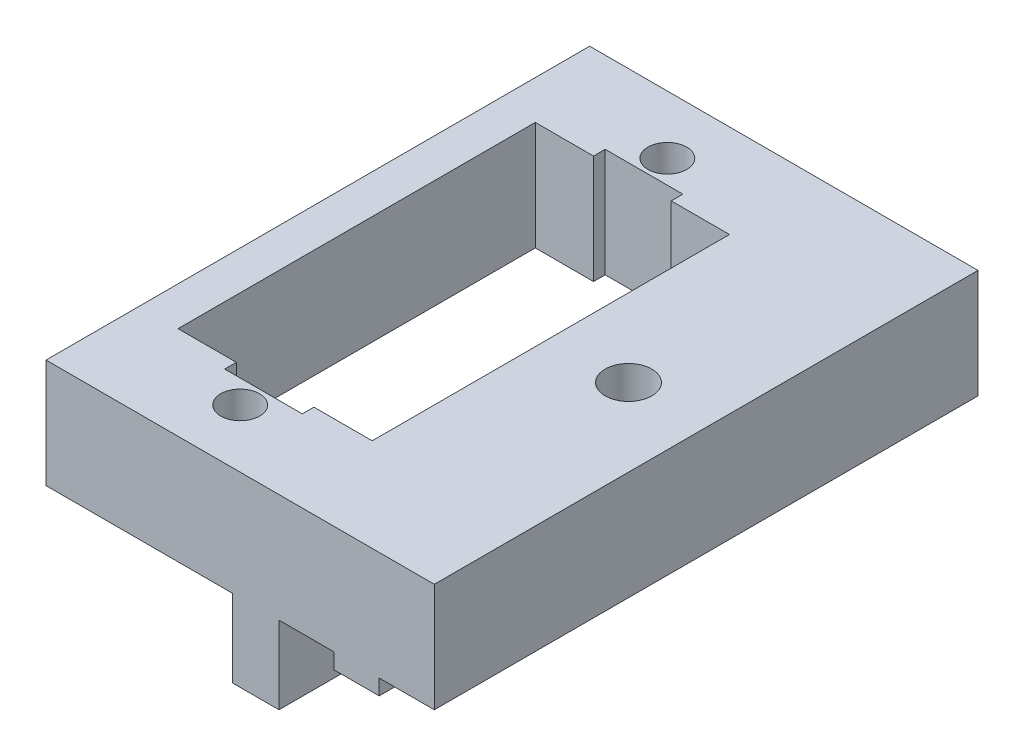
ISO-10303-21;
HEADER;
FILE_DESCRIPTION(('STEP AP214'),'2;1');
FILE_NAME('part.step','',(''),(''),'','','');
FILE_SCHEMA(('AUTOMOTIVE_DESIGN { 1 0 10303 214 1 1 1 1 }'));
ENDSEC;
DATA;
#1=APPLICATION_CONTEXT('core data for automotive mechanical design processes');
#2=APPLICATION_PROTOCOL_DEFINITION('international standard','automotive_design',2000,#1);
#3=PRODUCT_CONTEXT('',#1,'mechanical');
#4=PRODUCT('Part','Part','',(#3));
#5=PRODUCT_RELATED_PRODUCT_CATEGORY('part','',(#4));
#6=PRODUCT_DEFINITION_FORMATION('','',#4);
#7=PRODUCT_DEFINITION_CONTEXT('part definition',#1,'design');
#8=PRODUCT_DEFINITION('design','',#6,#7);
#9=PRODUCT_DEFINITION_SHAPE('','',#8);
#10=(LENGTH_UNIT() NAMED_UNIT(*) SI_UNIT(.MILLI.,.METRE.));
#11=(NAMED_UNIT(*) PLANE_ANGLE_UNIT() SI_UNIT($,.RADIAN.));
#12=(NAMED_UNIT(*) SI_UNIT($,.STERADIAN.) SOLID_ANGLE_UNIT());
#13=UNCERTAINTY_MEASURE_WITH_UNIT(LENGTH_MEASURE(1.E-05),#10,'distance_accuracy_value','');
#14=(GEOMETRIC_REPRESENTATION_CONTEXT(3) GLOBAL_UNCERTAINTY_ASSIGNED_CONTEXT((#13)) GLOBAL_UNIT_ASSIGNED_CONTEXT((#10,
#11,#12)) REPRESENTATION_CONTEXT('',''));
#15=CARTESIAN_POINT('',(0.,0.,0.));
#16=DIRECTION('',(0.,0.,1.));
#17=DIRECTION('',(1.,0.,0.));
#18=AXIS2_PLACEMENT_3D('',#15,#16,#17);
#19=CARTESIAN_POINT('',(-12.5,-5.00000000000001,-11.5));
#20=DIRECTION('',(0.,0.,-1.));
#21=DIRECTION('',(-1.,0.,0.));
#22=AXIS2_PLACEMENT_3D('',#19,#20,#21);
#23=PLANE('',#22);
#24=DIRECTION('',(-1.,0.,0.));
#25=VECTOR('',#24,1.);
#26=CARTESIAN_POINT('',(-12.5,7.,-11.5));
#27=LINE('',#26,#25);
#28=CARTESIAN_POINT('',(0.,7.,-11.5));
#29=VERTEX_POINT('',#28);
#30=CARTESIAN_POINT('',(-3.75,7.,-11.5));
#31=VERTEX_POINT('',#30);
#32=EDGE_CURVE('E288',#29,#31,#27,.T.);
#33=ORIENTED_EDGE('',*,*,#32,.T.);
#34=DIRECTION('',(0.,-1.,0.));
#35=VECTOR('',#34,1.);
#36=CARTESIAN_POINT('',(-3.75,-5.,-11.5));
#37=LINE('',#36,#35);
#38=CARTESIAN_POINT('',(-3.75,0.,-11.5));
#39=VERTEX_POINT('',#38);
#40=EDGE_CURVE('E253',#31,#39,#37,.T.);
#41=ORIENTED_EDGE('',*,*,#40,.T.);
#42=DIRECTION('',(-1.,0.,0.));
#43=VECTOR('',#42,1.);
#44=CARTESIAN_POINT('',(-15.,0.,-11.5));
#45=LINE('',#44,#43);
#46=CARTESIAN_POINT('',(-3.,0.,-11.5));
#47=VERTEX_POINT('',#46);
#48=EDGE_CURVE('E326',#47,#39,#45,.T.);
#49=ORIENTED_EDGE('',*,*,#48,.F.);
#50=DIRECTION('',(0.,1.,0.));
#51=VECTOR('',#50,1.);
#52=CARTESIAN_POINT('',(-3.,0.,-11.5));
#53=LINE('',#52,#51);
#54=CARTESIAN_POINT('',(-3.,-5.,-11.5));
#55=VERTEX_POINT('',#54);
#56=EDGE_CURVE('E322',#55,#47,#53,.T.);
#57=ORIENTED_EDGE('',*,*,#56,.F.);
#58=DIRECTION('',(-1.,0.,0.));
#59=VECTOR('',#58,1.);
#60=CARTESIAN_POINT('',(-12.5,-5.00000000000001,-11.5));
#61=LINE('',#60,#59);
#62=CARTESIAN_POINT('',(0.,-5.,-11.5));
#63=VERTEX_POINT('',#62);
#64=EDGE_CURVE('E287',#63,#55,#61,.T.);
#65=ORIENTED_EDGE('',*,*,#64,.F.);
#66=DIRECTION('',(0.,1.,0.));
#67=VECTOR('',#66,1.);
#68=CARTESIAN_POINT('',(0.,-5.,-11.5));
#69=LINE('',#68,#67);
#70=CARTESIAN_POINT('',(0.,0.,-11.5));
#71=VERTEX_POINT('',#70);
#72=EDGE_CURVE('E307',#63,#71,#69,.T.);
#73=ORIENTED_EDGE('',*,*,#72,.T.);
#74=EDGE_CURVE('E309',#71,#29,#69,.T.);
#75=ORIENTED_EDGE('',*,*,#74,.T.);
#76=EDGE_LOOP('',(#33,#41,#49,#57,#65,#73,#75));
#77=FACE_BOUND('',#76,.T.);
#78=ADVANCED_FACE('F33',(#77),#23,.F.);
#79=CARTESIAN_POINT('',(-12.5,-5.00000000000001,11.5));
#80=DIRECTION('',(0.,0.,1.));
#81=DIRECTION('',(1.,0.,0.));
#82=AXIS2_PLACEMENT_3D('',#79,#80,#81);
#83=PLANE('',#82);
#84=DIRECTION('',(1.,0.,0.));
#85=VECTOR('',#84,1.);
#86=CARTESIAN_POINT('',(-15.,0.,11.5));
#87=LINE('',#86,#85);
#88=CARTESIAN_POINT('',(-3.75,0.,11.5));
#89=VERTEX_POINT('',#88);
#90=CARTESIAN_POINT('',(-3.,0.,11.5));
#91=VERTEX_POINT('',#90);
#92=EDGE_CURVE('E318',#89,#91,#87,.T.);
#93=ORIENTED_EDGE('',*,*,#92,.F.);
#94=DIRECTION('',(0.,1.,0.));
#95=VECTOR('',#94,1.);
#96=CARTESIAN_POINT('',(-3.75,-5.,11.5));
#97=LINE('',#96,#95);
#98=CARTESIAN_POINT('',(-3.75,7.,11.5));
#99=VERTEX_POINT('',#98);
#100=EDGE_CURVE('E474',#89,#99,#97,.T.);
#101=ORIENTED_EDGE('',*,*,#100,.T.);
#102=DIRECTION('',(1.,0.,0.));
#103=VECTOR('',#102,1.);
#104=CARTESIAN_POINT('',(-12.5,7.,11.5));
#105=LINE('',#104,#103);
#106=CARTESIAN_POINT('',(0.,7.,11.5));
#107=VERTEX_POINT('',#106);
#108=EDGE_CURVE('E294',#99,#107,#105,.T.);
#109=ORIENTED_EDGE('',*,*,#108,.T.);
#110=DIRECTION('',(0.,1.,0.));
#111=VECTOR('',#110,1.);
#112=CARTESIAN_POINT('',(0.,-5.,11.5));
#113=LINE('',#112,#111);
#114=CARTESIAN_POINT('',(0.,0.,11.5));
#115=VERTEX_POINT('',#114);
#116=EDGE_CURVE('E313',#115,#107,#113,.T.);
#117=ORIENTED_EDGE('',*,*,#116,.F.);
#118=CARTESIAN_POINT('',(0.,-5.,11.5));
#119=VERTEX_POINT('',#118);
#120=EDGE_CURVE('E310',#119,#115,#113,.T.);
#121=ORIENTED_EDGE('',*,*,#120,.F.);
#122=DIRECTION('',(1.,0.,0.));
#123=VECTOR('',#122,1.);
#124=CARTESIAN_POINT('',(-12.5,-5.00000000000001,11.5));
#125=LINE('',#124,#123);
#126=CARTESIAN_POINT('',(-3.,-5.,11.5));
#127=VERTEX_POINT('',#126);
#128=EDGE_CURVE('E284',#127,#119,#125,.T.);
#129=ORIENTED_EDGE('',*,*,#128,.F.);
#130=DIRECTION('',(0.,-1.,0.));
#131=VECTOR('',#130,1.);
#132=CARTESIAN_POINT('',(-3.,0.,11.5));
#133=LINE('',#132,#131);
#134=EDGE_CURVE('E306',#91,#127,#133,.T.);
#135=ORIENTED_EDGE('',*,*,#134,.F.);
#136=EDGE_LOOP('',(#93,#101,#109,#117,#121,#129,#135));
#137=FACE_BOUND('',#136,.T.);
#138=ADVANCED_FACE('F494',(#137),#83,.F.);
#139=CARTESIAN_POINT('',(-3.,0.,17.5));
#140=DIRECTION('',(1.,0.,0.));
#141=DIRECTION('',(0.,1.,0.));
#142=AXIS2_PLACEMENT_3D('',#139,#140,#141);
#143=PLANE('',#142);
#144=DIRECTION('',(0.,0.,-1.));
#145=VECTOR('',#144,1.);
#146=CARTESIAN_POINT('',(-3.,-5.,17.5));
#147=LINE('',#146,#145);
#148=CARTESIAN_POINT('',(-3.,-5.,-17.5));
#149=VERTEX_POINT('',#148);
#150=EDGE_CURVE('E439',#55,#149,#147,.T.);
#151=ORIENTED_EDGE('',*,*,#150,.F.);
#152=ORIENTED_EDGE('',*,*,#56,.T.);
#153=DIRECTION('',(0.,0.,-1.));
#154=VECTOR('',#153,1.);
#155=CARTESIAN_POINT('',(-3.,0.,17.5));
#156=LINE('',#155,#154);
#157=CARTESIAN_POINT('',(-3.,0.,-17.5));
#158=VERTEX_POINT('',#157);
#159=EDGE_CURVE('E443',#47,#158,#156,.T.);
#160=ORIENTED_EDGE('',*,*,#159,.T.);
#161=DIRECTION('',(0.,-1.,0.));
#162=VECTOR('',#161,1.);
#163=CARTESIAN_POINT('',(-3.,0.,-17.5));
#164=LINE('',#163,#162);
#165=EDGE_CURVE('E395',#158,#149,#164,.T.);
#166=ORIENTED_EDGE('',*,*,#165,.T.);
#167=EDGE_LOOP('',(#151,#152,#160,#166));
#168=FACE_BOUND('',#167,.T.);
#169=ADVANCED_FACE('F554',(#168),#143,.F.);
#170=CARTESIAN_POINT('',(-3.,-5.,17.5));
#171=DIRECTION('',(0.,1.,0.));
#172=DIRECTION('',(-1.,0.,0.));
#173=AXIS2_PLACEMENT_3D('',#170,#171,#172);
#174=PLANE('',#173);
#175=DIRECTION('',(0.,0.,-1.));
#176=VECTOR('',#175,1.);
#177=CARTESIAN_POINT('',(0.,-5.,17.5));
#178=LINE('',#177,#176);
#179=CARTESIAN_POINT('',(0.,-5.,-17.5));
#180=VERTEX_POINT('',#179);
#181=EDGE_CURVE('E434',#63,#180,#178,.T.);
#182=ORIENTED_EDGE('',*,*,#181,.F.);
#183=ORIENTED_EDGE('',*,*,#64,.T.);
#184=ORIENTED_EDGE('',*,*,#150,.T.);
#185=DIRECTION('',(1.,0.,0.));
#186=VECTOR('',#185,1.);
#187=CARTESIAN_POINT('',(-3.,-5.,-17.5));
#188=LINE('',#187,#186);
#189=EDGE_CURVE('E398',#149,#180,#188,.T.);
#190=ORIENTED_EDGE('',*,*,#189,.T.);
#191=EDGE_LOOP('',(#182,#183,#184,#190));
#192=FACE_BOUND('',#191,.T.);
#193=ADVANCED_FACE('F607',(#192),#174,.F.);
#194=CARTESIAN_POINT('',(0.,-5.,17.5));
#195=DIRECTION('',(-1.,0.,0.));
#196=DIRECTION('',(0.,-1.,0.));
#197=AXIS2_PLACEMENT_3D('',#194,#195,#196);
#198=PLANE('',#197);
#199=DIRECTION('',(0.,0.,-1.));
#200=VECTOR('',#199,1.);
#201=CARTESIAN_POINT('',(0.,0.,17.5));
#202=LINE('',#201,#200);
#203=CARTESIAN_POINT('',(0.,0.,-17.5));
#204=VERTEX_POINT('',#203);
#205=EDGE_CURVE('E430',#71,#204,#202,.T.);
#206=ORIENTED_EDGE('',*,*,#205,.F.);
#207=ORIENTED_EDGE('',*,*,#72,.F.);
#208=ORIENTED_EDGE('',*,*,#181,.T.);
#209=DIRECTION('',(0.,1.,0.));
#210=VECTOR('',#209,1.);
#211=CARTESIAN_POINT('',(0.,-5.,-17.5));
#212=LINE('',#211,#210);
#213=EDGE_CURVE('E401',#180,#204,#212,.T.);
#214=ORIENTED_EDGE('',*,*,#213,.T.);
#215=EDGE_LOOP('',(#206,#207,#208,#214));
#216=FACE_BOUND('',#215,.T.);
#217=ADVANCED_FACE('F604',(#216),#198,.F.);
#218=CARTESIAN_POINT('',(3.55,0.,17.5));
#219=DIRECTION('',(1.,0.,0.));
#220=DIRECTION('',(0.,1.,0.));
#221=AXIS2_PLACEMENT_3D('',#218,#219,#220);
#222=PLANE('',#221);
#223=DIRECTION('',(0.,0.,-1.));
#224=VECTOR('',#223,1.);
#225=CARTESIAN_POINT('',(3.55,-1.,17.5));
#226=LINE('',#225,#224);
#227=CARTESIAN_POINT('',(3.55,-1.,-0.384057287393424));
#228=VERTEX_POINT('',#227);
#229=CARTESIAN_POINT('',(3.55,-1.,-17.5));
#230=VERTEX_POINT('',#229);
#231=EDGE_CURVE('E422',#228,#230,#226,.T.);
#232=ORIENTED_EDGE('',*,*,#231,.F.);
#233=DIRECTION('',(0.,1.,0.));
#234=VECTOR('',#233,1.);
#235=CARTESIAN_POINT('',(3.55,-5.,-0.384057287393427));
#236=LINE('',#235,#234);
#237=CARTESIAN_POINT('',(3.55,0.,-0.384057287393427));
#238=VERTEX_POINT('',#237);
#239=EDGE_CURVE('E343',#228,#238,#236,.T.);
#240=ORIENTED_EDGE('',*,*,#239,.T.);
#241=DIRECTION('',(0.,0.,-1.));
#242=VECTOR('',#241,1.);
#243=CARTESIAN_POINT('',(3.55,0.,17.5));
#244=LINE('',#243,#242);
#245=CARTESIAN_POINT('',(3.55,0.,-17.5));
#246=VERTEX_POINT('',#245);
#247=EDGE_CURVE('E426',#238,#246,#244,.T.);
#248=ORIENTED_EDGE('',*,*,#247,.T.);
#249=DIRECTION('',(0.,-1.,0.));
#250=VECTOR('',#249,1.);
#251=CARTESIAN_POINT('',(3.55,0.,-17.5));
#252=LINE('',#251,#250);
#253=EDGE_CURVE('E407',#246,#230,#252,.T.);
#254=ORIENTED_EDGE('',*,*,#253,.T.);
#255=EDGE_LOOP('',(#232,#240,#248,#254));
#256=FACE_BOUND('',#255,.T.);
#257=ADVANCED_FACE('F599',(#256),#222,.F.);
#258=CARTESIAN_POINT('',(3.55,-1.,17.5));
#259=DIRECTION('',(0.,1.,0.));
#260=DIRECTION('',(-1.,0.,0.));
#261=AXIS2_PLACEMENT_3D('',#258,#259,#260);
#262=PLANE('',#261);
#263=CARTESIAN_POINT('',(3.55,-1.,17.5));
#264=VERTEX_POINT('',#263);
#265=CARTESIAN_POINT('',(3.55,-1.,0.384057287393424));
#266=VERTEX_POINT('',#265);
#267=EDGE_CURVE('E423',#264,#266,#226,.T.);
#268=ORIENTED_EDGE('',*,*,#267,.T.);
#269=CARTESIAN_POINT('',(5.,-1.,0.));
#270=DIRECTION('',(0.,1.,0.));
#271=DIRECTION('',(-1.,0.,0.));
#272=AXIS2_PLACEMENT_3D('',#269,#270,#271);
#273=CIRCLE('',#272,1.5);
#274=CARTESIAN_POINT('',(6.45,-1.,0.384057287393439));
#275=VERTEX_POINT('',#274);
#276=EDGE_CURVE('E344',#266,#275,#273,.T.);
#277=ORIENTED_EDGE('',*,*,#276,.T.);
#278=DIRECTION('',(0.,0.,-1.));
#279=VECTOR('',#278,1.);
#280=CARTESIAN_POINT('',(6.45,-1.,17.5));
#281=LINE('',#280,#279);
#282=CARTESIAN_POINT('',(6.45,-1.,17.5));
#283=VERTEX_POINT('',#282);
#284=EDGE_CURVE('E419',#283,#275,#281,.T.);
#285=ORIENTED_EDGE('',*,*,#284,.F.);
#286=DIRECTION('',(1.,0.,0.));
#287=VECTOR('',#286,1.);
#288=CARTESIAN_POINT('',(3.55,-1.,17.5));
#289=LINE('',#288,#287);
#290=EDGE_CURVE('E379',#264,#283,#289,.T.);
#291=ORIENTED_EDGE('',*,*,#290,.F.);
#292=EDGE_LOOP('',(#268,#277,#285,#291));
#293=FACE_BOUND('',#292,.T.);
#294=ADVANCED_FACE('F595',(#293),#262,.F.);
#295=CARTESIAN_POINT('',(6.45,-1.,17.5));
#296=DIRECTION('',(-1.,0.,0.));
#297=DIRECTION('',(0.,0.,1.));
#298=AXIS2_PLACEMENT_3D('',#295,#296,#297);
#299=PLANE('',#298);
#300=ORIENTED_EDGE('',*,*,#284,.T.);
#301=DIRECTION('',(0.,1.,0.));
#302=VECTOR('',#301,1.);
#303=CARTESIAN_POINT('',(6.45,-5.,0.384057287393439));
#304=LINE('',#303,#302);
#305=CARTESIAN_POINT('',(6.45,0.,0.384057287393436));
#306=VERTEX_POINT('',#305);
#307=EDGE_CURVE('E462',#275,#306,#304,.T.);
#308=ORIENTED_EDGE('',*,*,#307,.T.);
#309=DIRECTION('',(0.,0.,-1.));
#310=VECTOR('',#309,1.);
#311=CARTESIAN_POINT('',(6.45,0.,17.5));
#312=LINE('',#311,#310);
#313=CARTESIAN_POINT('',(6.45,0.,17.5));
#314=VERTEX_POINT('',#313);
#315=EDGE_CURVE('E415',#314,#306,#312,.T.);
#316=ORIENTED_EDGE('',*,*,#315,.F.);
#317=DIRECTION('',(0.,1.,0.));
#318=VECTOR('',#317,1.);
#319=CARTESIAN_POINT('',(6.45,-1.,17.5));
#320=LINE('',#319,#318);
#321=EDGE_CURVE('E381',#283,#314,#320,.T.);
#322=ORIENTED_EDGE('',*,*,#321,.F.);
#323=EDGE_LOOP('',(#300,#308,#316,#322));
#324=FACE_BOUND('',#323,.T.);
#325=ADVANCED_FACE('F590',(#324),#299,.F.);
#326=CARTESIAN_POINT('',(6.45,0.,17.5));
#327=DIRECTION('',(0.,1.,0.));
#328=DIRECTION('',(0.,0.,1.));
#329=AXIS2_PLACEMENT_3D('',#326,#327,#328);
#330=PLANE('',#329);
#331=ORIENTED_EDGE('',*,*,#315,.T.);
#332=CARTESIAN_POINT('',(5.,0.,0.));
#333=DIRECTION('',(0.,1.,0.));
#334=DIRECTION('',(0.,0.,1.));
#335=AXIS2_PLACEMENT_3D('',#332,#333,#334);
#336=CIRCLE('',#335,1.5);
#337=CARTESIAN_POINT('',(6.45,0.,-0.384057287393439));
#338=VERTEX_POINT('',#337);
#339=EDGE_CURVE('E350',#306,#338,#336,.T.);
#340=ORIENTED_EDGE('',*,*,#339,.T.);
#341=CARTESIAN_POINT('',(6.45,0.,-17.5));
#342=VERTEX_POINT('',#341);
#343=EDGE_CURVE('E383',#338,#342,#312,.T.);
#344=ORIENTED_EDGE('',*,*,#343,.T.);
#345=DIRECTION('',(1.,0.,0.));
#346=VECTOR('',#345,1.);
#347=CARTESIAN_POINT('',(6.45,0.,-17.5));
#348=LINE('',#347,#346);
#349=CARTESIAN_POINT('',(10.,0.,-17.5));
#350=VERTEX_POINT('',#349);
#351=EDGE_CURVE('E356',#342,#350,#348,.T.);
#352=ORIENTED_EDGE('',*,*,#351,.T.);
#353=DIRECTION('',(0.,0.,-1.));
#354=VECTOR('',#353,1.);
#355=CARTESIAN_POINT('',(10.,0.,17.5));
#356=LINE('',#355,#354);
#357=CARTESIAN_POINT('',(10.,0.,17.5));
#358=VERTEX_POINT('',#357);
#359=EDGE_CURVE('E456',#358,#350,#356,.T.);
#360=ORIENTED_EDGE('',*,*,#359,.F.);
#361=DIRECTION('',(1.,0.,0.));
#362=VECTOR('',#361,1.);
#363=CARTESIAN_POINT('',(6.45,0.,17.5));
#364=LINE('',#363,#362);
#365=EDGE_CURVE('E357',#314,#358,#364,.T.);
#366=ORIENTED_EDGE('',*,*,#365,.F.);
#367=EDGE_LOOP('',(#331,#340,#344,#352,#360,#366));
#368=FACE_BOUND('',#367,.T.);
#369=ADVANCED_FACE('F35',(#368),#330,.F.);
#370=CARTESIAN_POINT('',(10.,0.,17.5));
#371=DIRECTION('',(-1.,0.,0.));
#372=DIRECTION('',(0.,0.,1.));
#373=AXIS2_PLACEMENT_3D('',#370,#371,#372);
#374=PLANE('',#373);
#375=DIRECTION('',(0.,1.,0.));
#376=VECTOR('',#375,1.);
#377=CARTESIAN_POINT('',(10.,0.,-17.5));
#378=LINE('',#377,#376);
#379=CARTESIAN_POINT('',(10.,7.,-17.5));
#380=VERTEX_POINT('',#379);
#381=EDGE_CURVE('E386',#350,#380,#378,.T.);
#382=ORIENTED_EDGE('',*,*,#381,.T.);
#383=DIRECTION('',(0.,0.,-1.));
#384=VECTOR('',#383,1.);
#385=CARTESIAN_POINT('',(10.,7.,17.5));
#386=LINE('',#385,#384);
#387=CARTESIAN_POINT('',(10.,7.,17.5));
#388=VERTEX_POINT('',#387);
#389=EDGE_CURVE('E453',#388,#380,#386,.T.);
#390=ORIENTED_EDGE('',*,*,#389,.F.);
#391=DIRECTION('',(0.,1.,0.));
#392=VECTOR('',#391,1.);
#393=CARTESIAN_POINT('',(10.,0.,17.5));
#394=LINE('',#393,#392);
#395=EDGE_CURVE('E360',#358,#388,#394,.T.);
#396=ORIENTED_EDGE('',*,*,#395,.F.);
#397=ORIENTED_EDGE('',*,*,#359,.T.);
#398=EDGE_LOOP('',(#382,#390,#396,#397));
#399=FACE_BOUND('',#398,.T.);
#400=ADVANCED_FACE('F616',(#399),#374,.F.);
#401=CARTESIAN_POINT('',(10.,7.,17.5));
#402=DIRECTION('',(0.,-1.,0.));
#403=DIRECTION('',(1.,0.,0.));
#404=AXIS2_PLACEMENT_3D('',#401,#402,#403);
#405=PLANE('',#404);
#406=ORIENTED_EDGE('',*,*,#108,.F.);
#407=DIRECTION('',(0.,0.,-1.));
#408=VECTOR('',#407,1.);
#409=CARTESIAN_POINT('',(-3.75,7.,12.25));
#410=LINE('',#409,#408);
#411=CARTESIAN_POINT('',(-3.75,7.,12.25));
#412=VERTEX_POINT('',#411);
#413=EDGE_CURVE('E257',#412,#99,#410,.T.);
#414=ORIENTED_EDGE('',*,*,#413,.F.);
#415=DIRECTION('',(1.,0.,0.));
#416=VECTOR('',#415,1.);
#417=CARTESIAN_POINT('',(-3.75,7.,12.25));
#418=LINE('',#417,#416);
#419=CARTESIAN_POINT('',(-8.75,7.,12.25));
#420=VERTEX_POINT('',#419);
#421=EDGE_CURVE('E247',#420,#412,#418,.T.);
#422=ORIENTED_EDGE('',*,*,#421,.F.);
#423=DIRECTION('',(0.,0.,1.));
#424=VECTOR('',#423,1.);
#425=CARTESIAN_POINT('',(-8.75,7.,12.25));
#426=LINE('',#425,#424);
#427=CARTESIAN_POINT('',(-8.75,7.,11.5));
#428=VERTEX_POINT('',#427);
#429=EDGE_CURVE('E263',#428,#420,#426,.T.);
#430=ORIENTED_EDGE('',*,*,#429,.F.);
#431=CARTESIAN_POINT('',(-12.5,7.,11.5));
#432=VERTEX_POINT('',#431);
#433=EDGE_CURVE('E295',#432,#428,#105,.T.);
#434=ORIENTED_EDGE('',*,*,#433,.F.);
#435=DIRECTION('',(0.,0.,1.));
#436=VECTOR('',#435,1.);
#437=CARTESIAN_POINT('',(-12.5,7.,-11.5));
#438=LINE('',#437,#436);
#439=CARTESIAN_POINT('',(-12.5,7.,-11.5));
#440=VERTEX_POINT('',#439);
#441=EDGE_CURVE('E292',#440,#432,#438,.T.);
#442=ORIENTED_EDGE('',*,*,#441,.F.);
#443=CARTESIAN_POINT('',(-8.75,7.,-11.5));
#444=VERTEX_POINT('',#443);
#445=EDGE_CURVE('E301',#444,#440,#27,.T.);
#446=ORIENTED_EDGE('',*,*,#445,.F.);
#447=CARTESIAN_POINT('',(-8.75,7.,-12.25));
#448=VERTEX_POINT('',#447);
#449=EDGE_CURVE('E48',#448,#444,#426,.T.);
#450=ORIENTED_EDGE('',*,*,#449,.F.);
#451=DIRECTION('',(-1.,0.,0.));
#452=VECTOR('',#451,1.);
#453=CARTESIAN_POINT('',(-3.75,7.,-12.25));
#454=LINE('',#453,#452);
#455=CARTESIAN_POINT('',(-3.75,7.,-12.25));
#456=VERTEX_POINT('',#455);
#457=EDGE_CURVE('E242',#456,#448,#454,.T.);
#458=ORIENTED_EDGE('',*,*,#457,.F.);
#459=EDGE_CURVE('E250',#31,#456,#410,.T.);
#460=ORIENTED_EDGE('',*,*,#459,.F.);
#461=ORIENTED_EDGE('',*,*,#32,.F.);
#462=DIRECTION('',(0.,0.,-1.));
#463=VECTOR('',#462,1.);
#464=CARTESIAN_POINT('',(0.,7.,-11.5));
#465=LINE('',#464,#463);
#466=EDGE_CURVE('E298',#107,#29,#465,.T.);
#467=ORIENTED_EDGE('',*,*,#466,.F.);
#468=EDGE_LOOP('',(#406,#414,#422,#430,#434,#442,#446,#450,#458,#460,#461,#467));
#469=FACE_BOUND('',#468,.T.);
#470=CARTESIAN_POINT('',(-6.25,7.,-13.75));
#471=DIRECTION('',(0.,1.,0.));
#472=DIRECTION('',(-1.,0.,0.));
#473=AXIS2_PLACEMENT_3D('',#470,#471,#472);
#474=CIRCLE('',#473,1.25);
#475=CARTESIAN_POINT('',(-7.5,7.,-13.75));
#476=VERTEX_POINT('',#475);
#477=EDGE_CURVE('E330',#476,#476,#474,.T.);
#478=ORIENTED_EDGE('',*,*,#477,.F.);
#479=EDGE_LOOP('',(#478));
#480=FACE_BOUND('',#479,.T.);
#481=CARTESIAN_POINT('',(-6.25,7.,13.75));
#482=DIRECTION('',(0.,1.,0.));
#483=DIRECTION('',(-1.,0.,0.));
#484=AXIS2_PLACEMENT_3D('',#481,#482,#483);
#485=CIRCLE('',#484,1.25);
#486=CARTESIAN_POINT('',(-7.5,7.,13.75));
#487=VERTEX_POINT('',#486);
#488=EDGE_CURVE('E329',#487,#487,#485,.T.);
#489=ORIENTED_EDGE('',*,*,#488,.F.);
#490=EDGE_LOOP('',(#489));
#491=FACE_BOUND('',#490,.T.);
#492=CARTESIAN_POINT('',(5.,7.,0.));
#493=DIRECTION('',(0.,1.,0.));
#494=DIRECTION('',(-1.,0.,0.));
#495=AXIS2_PLACEMENT_3D('',#492,#493,#494);
#496=CIRCLE('',#495,1.5);
#497=CARTESIAN_POINT('',(3.5,7.,0.));
#498=VERTEX_POINT('',#497);
#499=EDGE_CURVE('E336',#498,#498,#496,.T.);
#500=ORIENTED_EDGE('',*,*,#499,.F.);
#501=EDGE_LOOP('',(#500));
#502=FACE_BOUND('',#501,.T.);
#503=DIRECTION('',(-1.,0.,0.));
#504=VECTOR('',#503,1.);
#505=CARTESIAN_POINT('',(10.,7.,-17.5));
#506=LINE('',#505,#504);
#507=CARTESIAN_POINT('',(-15.,7.,-17.5));
#508=VERTEX_POINT('',#507);
#509=EDGE_CURVE('E388',#380,#508,#506,.T.);
#510=ORIENTED_EDGE('',*,*,#509,.T.);
#511=DIRECTION('',(0.,0.,-1.));
#512=VECTOR('',#511,1.);
#513=CARTESIAN_POINT('',(-15.,7.,17.5));
#514=LINE('',#513,#512);
#515=CARTESIAN_POINT('',(-15.,7.,17.5));
#516=VERTEX_POINT('',#515);
#517=EDGE_CURVE('E450',#516,#508,#514,.T.);
#518=ORIENTED_EDGE('',*,*,#517,.F.);
#519=DIRECTION('',(-1.,0.,0.));
#520=VECTOR('',#519,1.);
#521=CARTESIAN_POINT('',(10.,7.,17.5));
#522=LINE('',#521,#520);
#523=EDGE_CURVE('E363',#388,#516,#522,.T.);
#524=ORIENTED_EDGE('',*,*,#523,.F.);
#525=ORIENTED_EDGE('',*,*,#389,.T.);
#526=EDGE_LOOP('',(#510,#518,#524,#525));
#527=FACE_BOUND('',#526,.T.);
#528=ADVANCED_FACE('F260',(#469,#480,#491,#502,#527),#405,.F.);
#529=CARTESIAN_POINT('',(-15.,7.,17.5));
#530=DIRECTION('',(1.,0.,0.));
#531=DIRECTION('',(0.,1.,0.));
#532=AXIS2_PLACEMENT_3D('',#529,#530,#531);
#533=PLANE('',#532);
#534=DIRECTION('',(0.,-1.,0.));
#535=VECTOR('',#534,1.);
#536=CARTESIAN_POINT('',(-15.,7.,-17.5));
#537=LINE('',#536,#535);
#538=CARTESIAN_POINT('',(-15.,0.,-17.5));
#539=VERTEX_POINT('',#538);
#540=EDGE_CURVE('E390',#508,#539,#537,.T.);
#541=ORIENTED_EDGE('',*,*,#540,.T.);
#542=DIRECTION('',(0.,0.,-1.));
#543=VECTOR('',#542,1.);
#544=CARTESIAN_POINT('',(-15.,0.,17.5));
#545=LINE('',#544,#543);
#546=CARTESIAN_POINT('',(-15.,0.,17.5));
#547=VERTEX_POINT('',#546);
#548=EDGE_CURVE('E447',#547,#539,#545,.T.);
#549=ORIENTED_EDGE('',*,*,#548,.F.);
#550=DIRECTION('',(0.,-1.,0.));
#551=VECTOR('',#550,1.);
#552=CARTESIAN_POINT('',(-15.,7.,17.5));
#553=LINE('',#552,#551);
#554=EDGE_CURVE('E365',#516,#547,#553,.T.);
#555=ORIENTED_EDGE('',*,*,#554,.F.);
#556=ORIENTED_EDGE('',*,*,#517,.T.);
#557=EDGE_LOOP('',(#541,#549,#555,#556));
#558=FACE_BOUND('',#557,.T.);
#559=ADVANCED_FACE('F611',(#558),#533,.F.);
#560=CARTESIAN_POINT('',(-15.,0.,17.5));
#561=DIRECTION('',(0.,1.,0.));
#562=DIRECTION('',(-1.,0.,0.));
#563=AXIS2_PLACEMENT_3D('',#560,#561,#562);
#564=PLANE('',#563);
#565=DIRECTION('',(1.,0.,0.));
#566=VECTOR('',#565,1.);
#567=CARTESIAN_POINT('',(-15.,0.,12.25));
#568=LINE('',#567,#566);
#569=CARTESIAN_POINT('',(-8.75,0.,12.25));
#570=VERTEX_POINT('',#569);
#571=CARTESIAN_POINT('',(-3.75,0.,12.25));
#572=VERTEX_POINT('',#571);
#573=EDGE_CURVE('E11',#570,#572,#568,.T.);
#574=ORIENTED_EDGE('',*,*,#573,.T.);
#575=DIRECTION('',(0.,0.,-1.));
#576=VECTOR('',#575,1.);
#577=CARTESIAN_POINT('',(-3.75,0.,17.5));
#578=LINE('',#577,#576);
#579=EDGE_CURVE('E279',#572,#89,#578,.T.);
#580=ORIENTED_EDGE('',*,*,#579,.T.);
#581=ORIENTED_EDGE('',*,*,#92,.T.);
#582=CARTESIAN_POINT('',(-3.,0.,17.5));
#583=VERTEX_POINT('',#582);
#584=EDGE_CURVE('E444',#583,#91,#156,.T.);
#585=ORIENTED_EDGE('',*,*,#584,.F.);
#586=DIRECTION('',(1.,0.,0.));
#587=VECTOR('',#586,1.);
#588=CARTESIAN_POINT('',(-15.,0.,17.5));
#589=LINE('',#588,#587);
#590=EDGE_CURVE('E367',#547,#583,#589,.T.);
#591=ORIENTED_EDGE('',*,*,#590,.F.);
#592=ORIENTED_EDGE('',*,*,#548,.T.);
#593=DIRECTION('',(1.,0.,0.));
#594=VECTOR('',#593,1.);
#595=CARTESIAN_POINT('',(-15.,0.,-17.5));
#596=LINE('',#595,#594);
#597=EDGE_CURVE('E392',#539,#158,#596,.T.);
#598=ORIENTED_EDGE('',*,*,#597,.T.);
#599=ORIENTED_EDGE('',*,*,#159,.F.);
#600=ORIENTED_EDGE('',*,*,#48,.T.);
#601=CARTESIAN_POINT('',(-3.75,0.,-12.25));
#602=VERTEX_POINT('',#601);
#603=EDGE_CURVE('E282',#39,#602,#578,.T.);
#604=ORIENTED_EDGE('',*,*,#603,.T.);
#605=DIRECTION('',(-1.,0.,0.));
#606=VECTOR('',#605,1.);
#607=CARTESIAN_POINT('',(-15.,0.,-12.25));
#608=LINE('',#607,#606);
#609=CARTESIAN_POINT('',(-8.75,0.,-12.25));
#610=VERTEX_POINT('',#609);
#611=EDGE_CURVE('E41',#602,#610,#608,.T.);
#612=ORIENTED_EDGE('',*,*,#611,.T.);
#613=DIRECTION('',(0.,0.,1.));
#614=VECTOR('',#613,1.);
#615=CARTESIAN_POINT('',(-8.75,0.,17.5));
#616=LINE('',#615,#614);
#617=CARTESIAN_POINT('',(-8.75,0.,-11.5));
#618=VERTEX_POINT('',#617);
#619=EDGE_CURVE('E277',#610,#618,#616,.T.);
#620=ORIENTED_EDGE('',*,*,#619,.T.);
#621=CARTESIAN_POINT('',(-12.5,0.,-11.5));
#622=VERTEX_POINT('',#621);
#623=EDGE_CURVE('E325',#618,#622,#45,.T.);
#624=ORIENTED_EDGE('',*,*,#623,.T.);
#625=DIRECTION('',(0.,0.,1.));
#626=VECTOR('',#625,1.);
#627=CARTESIAN_POINT('',(-12.5,0.,17.5));
#628=LINE('',#627,#626);
#629=CARTESIAN_POINT('',(-12.5,0.,11.5));
#630=VERTEX_POINT('',#629);
#631=EDGE_CURVE('E465',#622,#630,#628,.T.);
#632=ORIENTED_EDGE('',*,*,#631,.T.);
#633=CARTESIAN_POINT('',(-8.75,0.,11.5));
#634=VERTEX_POINT('',#633);
#635=EDGE_CURVE('E319',#630,#634,#87,.T.);
#636=ORIENTED_EDGE('',*,*,#635,.T.);
#637=EDGE_CURVE('E56',#634,#570,#616,.T.);
#638=ORIENTED_EDGE('',*,*,#637,.T.);
#639=EDGE_LOOP('',(#574,#580,#581,#585,#591,#592,#598,#599,#600,#604,#612,#620,#624,#632,#636,#638));
#640=FACE_BOUND('',#639,.T.);
#641=CARTESIAN_POINT('',(-6.25,0.,-13.75));
#642=DIRECTION('',(0.,1.,0.));
#643=DIRECTION('',(-1.,0.,0.));
#644=AXIS2_PLACEMENT_3D('',#641,#642,#643);
#645=CIRCLE('',#644,1.25);
#646=CARTESIAN_POINT('',(-7.5,0.,-13.75));
#647=VERTEX_POINT('',#646);
#648=EDGE_CURVE('E340',#647,#647,#645,.T.);
#649=ORIENTED_EDGE('',*,*,#648,.T.);
#650=EDGE_LOOP('',(#649));
#651=FACE_BOUND('',#650,.T.);
#652=CARTESIAN_POINT('',(-6.25,0.,13.75));
#653=DIRECTION('',(0.,1.,0.));
#654=DIRECTION('',(-1.,0.,0.));
#655=AXIS2_PLACEMENT_3D('',#652,#653,#654);
#656=CIRCLE('',#655,1.25);
#657=CARTESIAN_POINT('',(-7.5,0.,13.75));
#658=VERTEX_POINT('',#657);
#659=EDGE_CURVE('E333',#658,#658,#656,.T.);
#660=ORIENTED_EDGE('',*,*,#659,.T.);
#661=EDGE_LOOP('',(#660));
#662=FACE_BOUND('',#661,.T.);
#663=ADVANCED_FACE('F478',(#640,#651,#662),#564,.F.);
#664=ORIENTED_EDGE('',*,*,#584,.T.);
#665=ORIENTED_EDGE('',*,*,#134,.T.);
#666=CARTESIAN_POINT('',(-3.,-5.,17.5));
#667=VERTEX_POINT('',#666);
#668=EDGE_CURVE('E440',#667,#127,#147,.T.);
#669=ORIENTED_EDGE('',*,*,#668,.F.);
#670=DIRECTION('',(0.,-1.,0.));
#671=VECTOR('',#670,1.);
#672=CARTESIAN_POINT('',(-3.,0.,17.5));
#673=LINE('',#672,#671);
#674=EDGE_CURVE('E369',#583,#667,#673,.T.);
#675=ORIENTED_EDGE('',*,*,#674,.F.);
#676=EDGE_LOOP('',(#664,#665,#669,#675));
#677=FACE_BOUND('',#676,.T.);
#678=ADVANCED_FACE('F516',(#677),#143,.F.);
#679=ORIENTED_EDGE('',*,*,#668,.T.);
#680=ORIENTED_EDGE('',*,*,#128,.T.);
#681=CARTESIAN_POINT('',(0.,-5.,17.5));
#682=VERTEX_POINT('',#681);
#683=EDGE_CURVE('E436',#682,#119,#178,.T.);
#684=ORIENTED_EDGE('',*,*,#683,.F.);
#685=DIRECTION('',(1.,0.,0.));
#686=VECTOR('',#685,1.);
#687=CARTESIAN_POINT('',(-3.,-5.,17.5));
#688=LINE('',#687,#686);
#689=EDGE_CURVE('E371',#667,#682,#688,.T.);
#690=ORIENTED_EDGE('',*,*,#689,.F.);
#691=EDGE_LOOP('',(#679,#680,#684,#690));
#692=FACE_BOUND('',#691,.T.);
#693=ADVANCED_FACE('F513',(#692),#174,.F.);
#694=ORIENTED_EDGE('',*,*,#683,.T.);
#695=ORIENTED_EDGE('',*,*,#120,.T.);
#696=CARTESIAN_POINT('',(0.,0.,17.5));
#697=VERTEX_POINT('',#696);
#698=EDGE_CURVE('E431',#697,#115,#202,.T.);
#699=ORIENTED_EDGE('',*,*,#698,.F.);
#700=DIRECTION('',(0.,1.,0.));
#701=VECTOR('',#700,1.);
#702=CARTESIAN_POINT('',(0.,-5.,17.5));
#703=LINE('',#702,#701);
#704=EDGE_CURVE('E373',#682,#697,#703,.T.);
#705=ORIENTED_EDGE('',*,*,#704,.F.);
#706=EDGE_LOOP('',(#694,#695,#699,#705));
#707=FACE_BOUND('',#706,.T.);
#708=ADVANCED_FACE('F497',(#707),#198,.F.);
#709=CARTESIAN_POINT('',(0.,0.,17.5));
#710=DIRECTION('',(0.,1.,0.));
#711=DIRECTION('',(-1.,0.,0.));
#712=AXIS2_PLACEMENT_3D('',#709,#710,#711);
#713=PLANE('',#712);
#714=ORIENTED_EDGE('',*,*,#247,.F.);
#715=CARTESIAN_POINT('',(5.,0.,0.));
#716=DIRECTION('',(0.,1.,0.));
#717=DIRECTION('',(-1.,0.,0.));
#718=AXIS2_PLACEMENT_3D('',#715,#716,#717);
#719=CIRCLE('',#718,1.5);
#720=CARTESIAN_POINT('',(3.55,0.,0.384057287393423));
#721=VERTEX_POINT('',#720);
#722=EDGE_CURVE('E347',#238,#721,#719,.T.);
#723=ORIENTED_EDGE('',*,*,#722,.T.);
#724=CARTESIAN_POINT('',(3.55,0.,17.5));
#725=VERTEX_POINT('',#724);
#726=EDGE_CURVE('E427',#725,#721,#244,.T.);
#727=ORIENTED_EDGE('',*,*,#726,.F.);
#728=DIRECTION('',(1.,0.,0.));
#729=VECTOR('',#728,1.);
#730=CARTESIAN_POINT('',(0.,0.,17.5));
#731=LINE('',#730,#729);
#732=EDGE_CURVE('E375',#697,#725,#731,.T.);
#733=ORIENTED_EDGE('',*,*,#732,.F.);
#734=ORIENTED_EDGE('',*,*,#698,.T.);
#735=EDGE_CURVE('E435',#115,#71,#202,.T.);
#736=ORIENTED_EDGE('',*,*,#735,.T.);
#737=ORIENTED_EDGE('',*,*,#205,.T.);
#738=DIRECTION('',(1.,0.,0.));
#739=VECTOR('',#738,1.);
#740=CARTESIAN_POINT('',(0.,0.,-17.5));
#741=LINE('',#740,#739);
#742=EDGE_CURVE('E404',#204,#246,#741,.T.);
#743=ORIENTED_EDGE('',*,*,#742,.T.);
#744=EDGE_LOOP('',(#714,#723,#727,#733,#734,#736,#737,#743));
#745=FACE_BOUND('',#744,.T.);
#746=ADVANCED_FACE('F503',(#745),#713,.F.);
#747=ORIENTED_EDGE('',*,*,#726,.T.);
#748=DIRECTION('',(0.,1.,0.));
#749=VECTOR('',#748,1.);
#750=CARTESIAN_POINT('',(3.55,-5.,0.384057287393427));
#751=LINE('',#750,#749);
#752=EDGE_CURVE('E353',#721,#266,#751,.F.);
#753=ORIENTED_EDGE('',*,*,#752,.T.);
#754=ORIENTED_EDGE('',*,*,#267,.F.);
#755=DIRECTION('',(0.,-1.,0.));
#756=VECTOR('',#755,1.);
#757=CARTESIAN_POINT('',(3.55,0.,17.5));
#758=LINE('',#757,#756);
#759=EDGE_CURVE('E377',#725,#264,#758,.T.);
#760=ORIENTED_EDGE('',*,*,#759,.F.);
#761=EDGE_LOOP('',(#747,#753,#754,#760));
#762=FACE_BOUND('',#761,.T.);
#763=ADVANCED_FACE('F593',(#762),#222,.F.);
#764=CARTESIAN_POINT('',(6.45,-1.,-0.384057287393439));
#765=VERTEX_POINT('',#764);
#766=CARTESIAN_POINT('',(6.45,-1.,-17.5));
#767=VERTEX_POINT('',#766);
#768=EDGE_CURVE('E418',#765,#767,#281,.T.);
#769=ORIENTED_EDGE('',*,*,#768,.F.);
#770=EDGE_CURVE('E339',#765,#228,#273,.T.);
#771=ORIENTED_EDGE('',*,*,#770,.T.);
#772=ORIENTED_EDGE('',*,*,#231,.T.);
#773=DIRECTION('',(1.,0.,0.));
#774=VECTOR('',#773,1.);
#775=CARTESIAN_POINT('',(3.55,-1.,-17.5));
#776=LINE('',#775,#774);
#777=EDGE_CURVE('E410',#230,#767,#776,.T.);
#778=ORIENTED_EDGE('',*,*,#777,.T.);
#779=EDGE_LOOP('',(#769,#771,#772,#778));
#780=FACE_BOUND('',#779,.T.);
#781=ADVANCED_FACE('F588',(#780),#262,.F.);
#782=ORIENTED_EDGE('',*,*,#343,.F.);
#783=DIRECTION('',(0.,1.,0.));
#784=VECTOR('',#783,1.);
#785=CARTESIAN_POINT('',(6.45,-5.,-0.384057287393439));
#786=LINE('',#785,#784);
#787=EDGE_CURVE('E459',#338,#765,#786,.F.);
#788=ORIENTED_EDGE('',*,*,#787,.T.);
#789=ORIENTED_EDGE('',*,*,#768,.T.);
#790=DIRECTION('',(0.,1.,0.));
#791=VECTOR('',#790,1.);
#792=CARTESIAN_POINT('',(6.45,-1.,-17.5));
#793=LINE('',#792,#791);
#794=EDGE_CURVE('E361',#767,#342,#793,.T.);
#795=ORIENTED_EDGE('',*,*,#794,.T.);
#796=EDGE_LOOP('',(#782,#788,#789,#795));
#797=FACE_BOUND('',#796,.T.);
#798=ADVANCED_FACE('F582',(#797),#299,.F.);
#799=CARTESIAN_POINT('',(0.,0.,17.5));
#800=DIRECTION('',(0.,0.,1.));
#801=DIRECTION('',(1.,0.,0.));
#802=AXIS2_PLACEMENT_3D('',#799,#800,#801);
#803=PLANE('',#802);
#804=ORIENTED_EDGE('',*,*,#365,.T.);
#805=ORIENTED_EDGE('',*,*,#395,.T.);
#806=ORIENTED_EDGE('',*,*,#523,.T.);
#807=ORIENTED_EDGE('',*,*,#554,.T.);
#808=ORIENTED_EDGE('',*,*,#590,.T.);
#809=ORIENTED_EDGE('',*,*,#674,.T.);
#810=ORIENTED_EDGE('',*,*,#689,.T.);
#811=ORIENTED_EDGE('',*,*,#704,.T.);
#812=ORIENTED_EDGE('',*,*,#732,.T.);
#813=ORIENTED_EDGE('',*,*,#759,.T.);
#814=ORIENTED_EDGE('',*,*,#290,.T.);
#815=ORIENTED_EDGE('',*,*,#321,.T.);
#816=EDGE_LOOP('',(#804,#805,#806,#807,#808,#809,#810,#811,#812,#813,#814,#815));
#817=FACE_BOUND('',#816,.T.);
#818=ADVANCED_FACE('F507',(#817),#803,.T.);
#819=CARTESIAN_POINT('',(0.,0.,-17.5));
#820=DIRECTION('',(0.,0.,1.));
#821=DIRECTION('',(1.,0.,0.));
#822=AXIS2_PLACEMENT_3D('',#819,#820,#821);
#823=PLANE('',#822);
#824=ORIENTED_EDGE('',*,*,#351,.F.);
#825=ORIENTED_EDGE('',*,*,#794,.F.);
#826=ORIENTED_EDGE('',*,*,#777,.F.);
#827=ORIENTED_EDGE('',*,*,#253,.F.);
#828=ORIENTED_EDGE('',*,*,#742,.F.);
#829=ORIENTED_EDGE('',*,*,#213,.F.);
#830=ORIENTED_EDGE('',*,*,#189,.F.);
#831=ORIENTED_EDGE('',*,*,#165,.F.);
#832=ORIENTED_EDGE('',*,*,#597,.F.);
#833=ORIENTED_EDGE('',*,*,#540,.F.);
#834=ORIENTED_EDGE('',*,*,#509,.F.);
#835=ORIENTED_EDGE('',*,*,#381,.F.);
#836=EDGE_LOOP('',(#824,#825,#826,#827,#828,#829,#830,#831,#832,#833,#834,#835));
#837=FACE_BOUND('',#836,.T.);
#838=ADVANCED_FACE('F578',(#837),#823,.F.);
#839=CARTESIAN_POINT('',(5.,-5.,0.));
#840=DIRECTION('',(0.,1.,0.));
#841=DIRECTION('',(-1.,0.,0.));
#842=AXIS2_PLACEMENT_3D('',#839,#840,#841);
#843=CYLINDRICAL_SURFACE('',#842,1.5);
#844=ORIENTED_EDGE('',*,*,#499,.T.);
#845=EDGE_LOOP('',(#844));
#846=FACE_BOUND('',#845,.T.);
#847=ORIENTED_EDGE('',*,*,#722,.F.);
#848=ORIENTED_EDGE('',*,*,#239,.F.);
#849=ORIENTED_EDGE('',*,*,#770,.F.);
#850=ORIENTED_EDGE('',*,*,#787,.F.);
#851=ORIENTED_EDGE('',*,*,#339,.F.);
#852=ORIENTED_EDGE('',*,*,#307,.F.);
#853=ORIENTED_EDGE('',*,*,#276,.F.);
#854=ORIENTED_EDGE('',*,*,#752,.F.);
#855=EDGE_LOOP('',(#847,#848,#849,#850,#851,#852,#853,#854));
#856=FACE_BOUND('',#855,.T.);
#857=ADVANCED_FACE('F574',(#846,#856),#843,.F.);
#858=CARTESIAN_POINT('',(-6.25,-5.,13.75));
#859=DIRECTION('',(0.,1.,0.));
#860=DIRECTION('',(-1.,0.,0.));
#861=AXIS2_PLACEMENT_3D('',#858,#859,#860);
#862=CYLINDRICAL_SURFACE('',#861,1.25);
#863=ORIENTED_EDGE('',*,*,#488,.T.);
#864=EDGE_LOOP('',(#863));
#865=FACE_BOUND('',#864,.T.);
#866=ORIENTED_EDGE('',*,*,#659,.F.);
#867=EDGE_LOOP('',(#866));
#868=FACE_BOUND('',#867,.T.);
#869=ADVANCED_FACE('F568',(#865,#868),#862,.F.);
#870=CARTESIAN_POINT('',(-6.25,-5.,-13.75));
#871=DIRECTION('',(0.,1.,0.));
#872=DIRECTION('',(-1.,0.,0.));
#873=AXIS2_PLACEMENT_3D('',#870,#871,#872);
#874=CYLINDRICAL_SURFACE('',#873,1.25);
#875=ORIENTED_EDGE('',*,*,#477,.T.);
#876=EDGE_LOOP('',(#875));
#877=FACE_BOUND('',#876,.T.);
#878=ORIENTED_EDGE('',*,*,#648,.F.);
#879=EDGE_LOOP('',(#878));
#880=FACE_BOUND('',#879,.T.);
#881=ADVANCED_FACE('F563',(#877,#880),#874,.F.);
#882=CARTESIAN_POINT('',(-12.5,-5.00000000000001,-11.5));
#883=DIRECTION('',(-1.,0.,0.));
#884=DIRECTION('',(0.,-1.,0.));
#885=AXIS2_PLACEMENT_3D('',#882,#883,#884);
#886=PLANE('',#885);
#887=DIRECTION('',(0.,1.,0.));
#888=VECTOR('',#887,1.);
#889=CARTESIAN_POINT('',(-12.5,-5.00000000000001,-11.5));
#890=LINE('',#889,#888);
#891=EDGE_CURVE('E303',#622,#440,#890,.T.);
#892=ORIENTED_EDGE('',*,*,#891,.T.);
#893=ORIENTED_EDGE('',*,*,#441,.T.);
#894=DIRECTION('',(0.,1.,0.));
#895=VECTOR('',#894,1.);
#896=CARTESIAN_POINT('',(-12.5,-5.00000000000001,11.5));
#897=LINE('',#896,#895);
#898=EDGE_CURVE('E291',#630,#432,#897,.T.);
#899=ORIENTED_EDGE('',*,*,#898,.F.);
#900=ORIENTED_EDGE('',*,*,#631,.F.);
#901=EDGE_LOOP('',(#892,#893,#899,#900));
#902=FACE_BOUND('',#901,.T.);
#903=ADVANCED_FACE('F534',(#902),#886,.F.);
#904=ORIENTED_EDGE('',*,*,#623,.F.);
#905=DIRECTION('',(0.,1.,0.));
#906=VECTOR('',#905,1.);
#907=CARTESIAN_POINT('',(-8.75,-5.,-11.5));
#908=LINE('',#907,#906);
#909=EDGE_CURVE('E276',#618,#444,#908,.T.);
#910=ORIENTED_EDGE('',*,*,#909,.T.);
#911=ORIENTED_EDGE('',*,*,#445,.T.);
#912=ORIENTED_EDGE('',*,*,#891,.F.);
#913=EDGE_LOOP('',(#904,#910,#911,#912));
#914=FACE_BOUND('',#913,.T.);
#915=ADVANCED_FACE('F537',(#914),#23,.F.);
#916=ORIENTED_EDGE('',*,*,#433,.T.);
#917=DIRECTION('',(0.,-1.,0.));
#918=VECTOR('',#917,1.);
#919=CARTESIAN_POINT('',(-8.75,-5.,11.5));
#920=LINE('',#919,#918);
#921=EDGE_CURVE('E472',#428,#634,#920,.T.);
#922=ORIENTED_EDGE('',*,*,#921,.T.);
#923=ORIENTED_EDGE('',*,*,#635,.F.);
#924=ORIENTED_EDGE('',*,*,#898,.T.);
#925=EDGE_LOOP('',(#916,#922,#923,#924));
#926=FACE_BOUND('',#925,.T.);
#927=ADVANCED_FACE('F529',(#926),#83,.F.);
#928=CARTESIAN_POINT('',(0.,-5.,-11.5));
#929=DIRECTION('',(1.,0.,0.));
#930=DIRECTION('',(0.,1.,0.));
#931=AXIS2_PLACEMENT_3D('',#928,#929,#930);
#932=PLANE('',#931);
#933=ORIENTED_EDGE('',*,*,#116,.T.);
#934=ORIENTED_EDGE('',*,*,#466,.T.);
#935=ORIENTED_EDGE('',*,*,#74,.F.);
#936=ORIENTED_EDGE('',*,*,#735,.F.);
#937=EDGE_LOOP('',(#933,#934,#935,#936));
#938=FACE_BOUND('',#937,.T.);
#939=ADVANCED_FACE('F488',(#938),#932,.F.);
#940=CARTESIAN_POINT('',(-3.75,-5.00000000000001,12.25));
#941=DIRECTION('',(1.,0.,0.));
#942=DIRECTION('',(0.,1.,0.));
#943=AXIS2_PLACEMENT_3D('',#940,#941,#942);
#944=PLANE('',#943);
#945=DIRECTION('',(0.,1.,0.));
#946=VECTOR('',#945,1.);
#947=CARTESIAN_POINT('',(-3.75,-5.00000000000001,12.25));
#948=LINE('',#947,#946);
#949=EDGE_CURVE('E270',#572,#412,#948,.T.);
#950=ORIENTED_EDGE('',*,*,#949,.T.);
#951=ORIENTED_EDGE('',*,*,#413,.T.);
#952=ORIENTED_EDGE('',*,*,#100,.F.);
#953=ORIENTED_EDGE('',*,*,#579,.F.);
#954=EDGE_LOOP('',(#950,#951,#952,#953));
#955=FACE_BOUND('',#954,.T.);
#956=ADVANCED_FACE('F520',(#955),#944,.F.);
#957=CARTESIAN_POINT('',(-8.75,-5.00000000000001,12.25));
#958=DIRECTION('',(-1.,0.,0.));
#959=DIRECTION('',(0.,-1.,0.));
#960=AXIS2_PLACEMENT_3D('',#957,#958,#959);
#961=PLANE('',#960);
#962=ORIENTED_EDGE('',*,*,#921,.F.);
#963=ORIENTED_EDGE('',*,*,#429,.T.);
#964=DIRECTION('',(0.,1.,0.));
#965=VECTOR('',#964,1.);
#966=CARTESIAN_POINT('',(-8.75,-5.00000000000001,12.25));
#967=LINE('',#966,#965);
#968=EDGE_CURVE('E272',#570,#420,#967,.T.);
#969=ORIENTED_EDGE('',*,*,#968,.F.);
#970=ORIENTED_EDGE('',*,*,#637,.F.);
#971=EDGE_LOOP('',(#962,#963,#969,#970));
#972=FACE_BOUND('',#971,.T.);
#973=ADVANCED_FACE('F527',(#972),#961,.F.);
#974=CARTESIAN_POINT('',(-3.75,-5.00000000000001,12.25));
#975=DIRECTION('',(0.,0.,1.));
#976=DIRECTION('',(1.,0.,0.));
#977=AXIS2_PLACEMENT_3D('',#974,#975,#976);
#978=PLANE('',#977);
#979=ORIENTED_EDGE('',*,*,#968,.T.);
#980=ORIENTED_EDGE('',*,*,#421,.T.);
#981=ORIENTED_EDGE('',*,*,#949,.F.);
#982=ORIENTED_EDGE('',*,*,#573,.F.);
#983=EDGE_LOOP('',(#979,#980,#981,#982));
#984=FACE_BOUND('',#983,.T.);
#985=ADVANCED_FACE('F526',(#984),#978,.F.);
#986=CARTESIAN_POINT('',(-3.75,-5.00000000000001,-12.25));
#987=DIRECTION('',(0.,0.,-1.));
#988=DIRECTION('',(-1.,0.,0.));
#989=AXIS2_PLACEMENT_3D('',#986,#987,#988);
#990=PLANE('',#989);
#991=DIRECTION('',(0.,1.,0.));
#992=VECTOR('',#991,1.);
#993=CARTESIAN_POINT('',(-3.75,-5.00000000000001,-12.25));
#994=LINE('',#993,#992);
#995=EDGE_CURVE('E237',#602,#456,#994,.T.);
#996=ORIENTED_EDGE('',*,*,#995,.T.);
#997=ORIENTED_EDGE('',*,*,#457,.T.);
#998=DIRECTION('',(0.,1.,0.));
#999=VECTOR('',#998,1.);
#1000=CARTESIAN_POINT('',(-8.75,-5.00000000000001,-12.25));
#1001=LINE('',#1000,#999);
#1002=EDGE_CURVE('E246',#610,#448,#1001,.T.);
#1003=ORIENTED_EDGE('',*,*,#1002,.F.);
#1004=ORIENTED_EDGE('',*,*,#611,.F.);
#1005=EDGE_LOOP('',(#996,#997,#1003,#1004));
#1006=FACE_BOUND('',#1005,.T.);
#1007=ADVANCED_FACE('F239',(#1006),#990,.F.);
#1008=ORIENTED_EDGE('',*,*,#40,.F.);
#1009=ORIENTED_EDGE('',*,*,#459,.T.);
#1010=ORIENTED_EDGE('',*,*,#995,.F.);
#1011=ORIENTED_EDGE('',*,*,#603,.F.);
#1012=EDGE_LOOP('',(#1008,#1009,#1010,#1011));
#1013=FACE_BOUND('',#1012,.T.);
#1014=ADVANCED_FACE('F251',(#1013),#944,.F.);
#1015=ORIENTED_EDGE('',*,*,#1002,.T.);
#1016=ORIENTED_EDGE('',*,*,#449,.T.);
#1017=ORIENTED_EDGE('',*,*,#909,.F.);
#1018=ORIENTED_EDGE('',*,*,#619,.F.);
#1019=EDGE_LOOP('',(#1015,#1016,#1017,#1018));
#1020=FACE_BOUND('',#1019,.T.);
#1021=ADVANCED_FACE('F538',(#1020),#961,.F.);
#1022=CLOSED_SHELL('',(#78,#138,#169,#193,#217,#257,#294,#325,#369,#400,#528,#559,#663,#678,
#693,#708,#746,#763,#781,#798,#818,#838,#857,#869,#881,#903,#915,#927,#939,#956,#973,#985,#1007,
#1014,#1021));
#1023=MANIFOLD_SOLID_BREP('B2',#1022);
#1024=ADVANCED_BREP_SHAPE_REPRESENTATION('',(#18,#1023),#14);
#1025=SHAPE_DEFINITION_REPRESENTATION(#9,#1024);
ENDSEC;
END-ISO-10303-21;
